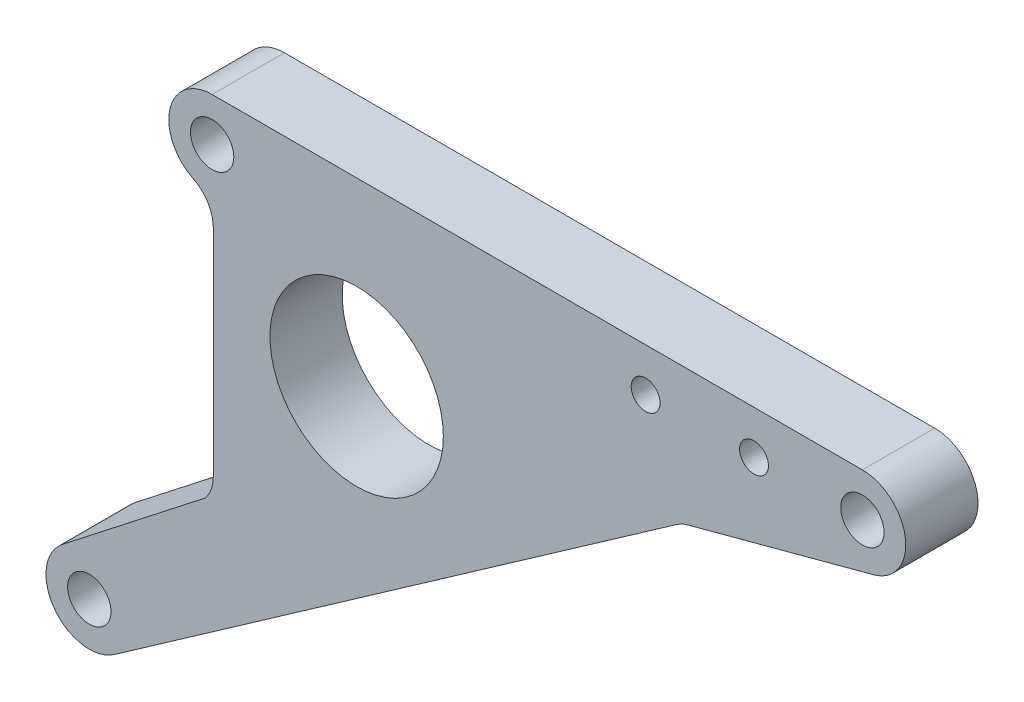
ISO-10303-21;
HEADER;
FILE_DESCRIPTION(('STEP AP214'),'2;1');
FILE_NAME('part.step','',(''),(''),'','','');
FILE_SCHEMA(('AUTOMOTIVE_DESIGN { 1 0 10303 214 1 1 1 1 }'));
ENDSEC;
DATA;
#1=APPLICATION_CONTEXT('core data for automotive mechanical design processes');
#2=APPLICATION_PROTOCOL_DEFINITION('international standard','automotive_design',2000,#1);
#3=PRODUCT_CONTEXT('',#1,'mechanical');
#4=PRODUCT('Part','Part','',(#3));
#5=PRODUCT_RELATED_PRODUCT_CATEGORY('part','',(#4));
#6=PRODUCT_DEFINITION_FORMATION('','',#4);
#7=PRODUCT_DEFINITION_CONTEXT('part definition',#1,'design');
#8=PRODUCT_DEFINITION('design','',#6,#7);
#9=PRODUCT_DEFINITION_SHAPE('','',#8);
#10=(LENGTH_UNIT() NAMED_UNIT(*) SI_UNIT(.MILLI.,.METRE.));
#11=(NAMED_UNIT(*) PLANE_ANGLE_UNIT() SI_UNIT($,.RADIAN.));
#12=(NAMED_UNIT(*) SI_UNIT($,.STERADIAN.) SOLID_ANGLE_UNIT());
#13=UNCERTAINTY_MEASURE_WITH_UNIT(LENGTH_MEASURE(1.E-05),#10,'distance_accuracy_value','');
#14=(GEOMETRIC_REPRESENTATION_CONTEXT(3) GLOBAL_UNCERTAINTY_ASSIGNED_CONTEXT((#13)) GLOBAL_UNIT_ASSIGNED_CONTEXT((#10,
#11,#12)) REPRESENTATION_CONTEXT('',''));
#15=CARTESIAN_POINT('',(0.,0.,0.));
#16=DIRECTION('',(0.,0.,1.));
#17=DIRECTION('',(1.,0.,0.));
#18=AXIS2_PLACEMENT_3D('',#15,#16,#17);
#19=CARTESIAN_POINT('',(16.0863109995939,48.5462870567651,10.));
#20=DIRECTION('',(0.,0.,1.));
#21=DIRECTION('',(1.,0.,0.));
#22=AXIS2_PLACEMENT_3D('',#19,#20,#21);
#23=PLANE('',#22);
#24=CARTESIAN_POINT('',(-90.9136890004061,-14.4537129432349,10.));
#25=DIRECTION('',(0.,0.,1.));
#26=DIRECTION('',(1.,0.,0.));
#27=AXIS2_PLACEMENT_3D('',#24,#25,#26);
#28=CIRCLE('',#27,3.00000000000001);
#29=CARTESIAN_POINT('',(-87.9136890004061,-14.4537129432349,10.));
#30=VERTEX_POINT('',#29);
#31=EDGE_CURVE('E285',#30,#30,#28,.T.);
#32=ORIENTED_EDGE('',*,*,#31,.F.);
#33=EDGE_LOOP('',(#32));
#34=FACE_BOUND('',#33,.T.);
#35=CARTESIAN_POINT('',(-13.9136890004061,48.5462870567651,10.));
#36=DIRECTION('',(0.,0.,1.));
#37=DIRECTION('',(1.,0.,0.));
#38=AXIS2_PLACEMENT_3D('',#35,#36,#37);
#39=CIRCLE('',#38,2.);
#40=CARTESIAN_POINT('',(-11.9136890004061,48.5462870567651,10.));
#41=VERTEX_POINT('',#40);
#42=EDGE_CURVE('E297',#41,#41,#39,.T.);
#43=ORIENTED_EDGE('',*,*,#42,.F.);
#44=EDGE_LOOP('',(#43));
#45=FACE_BOUND('',#44,.T.);
#46=CARTESIAN_POINT('',(16.0863109995939,48.5462870567651,10.));
#47=DIRECTION('',(0.,0.,1.));
#48=DIRECTION('',(1.,0.,0.));
#49=AXIS2_PLACEMENT_3D('',#46,#47,#48);
#50=CIRCLE('',#49,3.);
#51=CARTESIAN_POINT('',(19.0863109995939,48.5462870567651,10.));
#52=VERTEX_POINT('',#51);
#53=EDGE_CURVE('E152',#52,#52,#50,.T.);
#54=ORIENTED_EDGE('',*,*,#53,.F.);
#55=EDGE_LOOP('',(#54));
#56=FACE_BOUND('',#55,.T.);
#57=CARTESIAN_POINT('',(16.0863109995939,48.5462870567651,10.));
#58=DIRECTION('',(0.,0.,1.));
#59=DIRECTION('',(1.,0.,0.));
#60=AXIS2_PLACEMENT_3D('',#57,#58,#59);
#61=CIRCLE('',#60,6.);
#62=CARTESIAN_POINT('',(17.639225270209,42.7507320990307,10.));
#63=VERTEX_POINT('',#62);
#64=CARTESIAN_POINT('',(16.0863109995939,54.5462870567651,10.));
#65=VERTEX_POINT('',#64);
#66=EDGE_CURVE('E169',#63,#65,#61,.T.);
#67=ORIENTED_EDGE('',*,*,#66,.T.);
#68=DIRECTION('',(-1.,0.,0.));
#69=VECTOR('',#68,1.);
#70=CARTESIAN_POINT('',(16.0863109995939,54.5462870567651,10.));
#71=LINE('',#70,#69);
#72=CARTESIAN_POINT('',(-73.9136890004061,54.5462870567651,10.));
#73=VERTEX_POINT('',#72);
#74=EDGE_CURVE('E102',#65,#73,#71,.T.);
#75=ORIENTED_EDGE('',*,*,#74,.T.);
#76=CARTESIAN_POINT('',(-73.9136890004061,48.5462870567651,10.));
#77=DIRECTION('',(0.,0.,1.));
#78=DIRECTION('',(1.,0.,0.));
#79=AXIS2_PLACEMENT_3D('',#76,#77,#78);
#80=CIRCLE('',#79,6.);
#81=CARTESIAN_POINT('',(-76.5543108859951,43.1586051751626,10.));
#82=VERTEX_POINT('',#81);
#83=EDGE_CURVE('E193',#73,#82,#80,.T.);
#84=ORIENTED_EDGE('',*,*,#83,.T.);
#85=CARTESIAN_POINT('',(-78.7548291239859,38.6688702738271,10.));
#86=DIRECTION('',(0.,0.,-1.));
#87=DIRECTION('',(-1.,0.,0.));
#88=AXIS2_PLACEMENT_3D('',#85,#86,#87);
#89=CIRCLE('',#88,5.);
#90=CARTESIAN_POINT('',(-73.7548291239859,38.6688702738271,10.));
#91=VERTEX_POINT('',#90);
#92=EDGE_CURVE('E212',#82,#91,#89,.T.);
#93=ORIENTED_EDGE('',*,*,#92,.T.);
#94=DIRECTION('',(0.,-1.,0.));
#95=VECTOR('',#94,1.);
#96=CARTESIAN_POINT('',(-73.7548291239859,38.6688702738271,10.));
#97=LINE('',#96,#95);
#98=CARTESIAN_POINT('',(-73.7548291239859,8.83341218500627,10.));
#99=VERTEX_POINT('',#98);
#100=EDGE_CURVE('E209',#91,#99,#97,.T.);
#101=ORIENTED_EDGE('',*,*,#100,.T.);
#102=CARTESIAN_POINT('',(-78.7548291239859,8.83341218500627,10.));
#103=DIRECTION('',(0.,0.,-1.));
#104=DIRECTION('',(-1.,0.,0.));
#105=AXIS2_PLACEMENT_3D('',#102,#103,#104);
#106=CIRCLE('',#105,4.99999999999999);
#107=CARTESIAN_POINT('',(-74.8496115638818,5.71102915144772,10.));
#108=VERTEX_POINT('',#107);
#109=EDGE_CURVE('E211',#99,#108,#106,.T.);
#110=ORIENTED_EDGE('',*,*,#109,.T.);
#111=DIRECTION('',(-0.788010753606726,-0.615661475325654,0.));
#112=VECTOR('',#111,1.);
#113=CARTESIAN_POINT('',(-74.8496115638818,5.71102915144772,10.));
#114=LINE('',#113,#112);
#115=CARTESIAN_POINT('',(-94.60765785236,-9.72564842159455,10.));
#116=VERTEX_POINT('',#115);
#117=EDGE_CURVE('E214',#108,#116,#114,.T.);
#118=ORIENTED_EDGE('',*,*,#117,.T.);
#119=CARTESIAN_POINT('',(-90.9136890004061,-14.4537129432349,10.));
#120=DIRECTION('',(0.,0.,1.));
#121=DIRECTION('',(1.,0.,0.));
#122=AXIS2_PLACEMENT_3D('',#119,#120,#121);
#123=CIRCLE('',#122,6.);
#124=CARTESIAN_POINT('',(-87.4722303822998,-19.3686252089689,10.));
#125=VERTEX_POINT('',#124);
#126=EDGE_CURVE('E130',#116,#125,#123,.T.);
#127=ORIENTED_EDGE('',*,*,#126,.T.);
#128=DIRECTION('',(0.819152044288991,0.573576436351047,0.));
#129=VECTOR('',#128,1.);
#130=CARTESIAN_POINT('',(-87.4722303822998,-19.3686252089689,10.));
#131=LINE('',#130,#129);
#132=CARTESIAN_POINT('',(-9.64226130666265,35.128505836421,10.));
#133=VERTEX_POINT('',#132);
#134=EDGE_CURVE('E124',#125,#133,#131,.T.);
#135=ORIENTED_EDGE('',*,*,#134,.T.);
#136=CARTESIAN_POINT('',(-6.77437912490741,31.0327456149761,10.));
#137=DIRECTION('',(0.,0.,-1.));
#138=DIRECTION('',(1.,0.,0.));
#139=AXIS2_PLACEMENT_3D('',#136,#137,#138);
#140=CIRCLE('',#139,4.99999999999999);
#141=CARTESIAN_POINT('',(-8.06847435041998,35.8623747464214,10.));
#142=VERTEX_POINT('',#141);
#143=EDGE_CURVE('E128',#133,#142,#140,.T.);
#144=ORIENTED_EDGE('',*,*,#143,.T.);
#145=DIRECTION('',(0.96592582628907,0.258819045102515,0.));
#146=VECTOR('',#145,1.);
#147=CARTESIAN_POINT('',(-8.06847435041998,35.8623747464214,10.));
#148=LINE('',#147,#146);
#149=EDGE_CURVE('E50',#142,#63,#148,.T.);
#150=ORIENTED_EDGE('',*,*,#149,.T.);
#151=EDGE_LOOP('',(#67,#75,#84,#93,#101,#110,#118,#127,#135,#144,#150));
#152=FACE_BOUND('',#151,.T.);
#153=CARTESIAN_POINT('',(1.08631099959389,48.5462870567651,10.));
#154=DIRECTION('',(0.,0.,1.));
#155=DIRECTION('',(1.,0.,0.));
#156=AXIS2_PLACEMENT_3D('',#153,#154,#155);
#157=CIRCLE('',#156,2.);
#158=CARTESIAN_POINT('',(3.0863109995939,48.5462870567651,10.));
#159=VERTEX_POINT('',#158);
#160=EDGE_CURVE('E303',#159,#159,#157,.T.);
#161=ORIENTED_EDGE('',*,*,#160,.F.);
#162=EDGE_LOOP('',(#161));
#163=FACE_BOUND('',#162,.T.);
#164=CARTESIAN_POINT('',(-73.9136890004061,48.5462870567651,10.));
#165=DIRECTION('',(0.,0.,1.));
#166=DIRECTION('',(1.,0.,0.));
#167=AXIS2_PLACEMENT_3D('',#164,#165,#166);
#168=CIRCLE('',#167,3.00000000000001);
#169=CARTESIAN_POINT('',(-70.9136890004061,48.5462870567651,10.));
#170=VERTEX_POINT('',#169);
#171=EDGE_CURVE('E291',#170,#170,#168,.T.);
#172=ORIENTED_EDGE('',*,*,#171,.F.);
#173=EDGE_LOOP('',(#172));
#174=FACE_BOUND('',#173,.T.);
#175=CARTESIAN_POINT('',(-53.9136890004061,29.5462870567651,10.));
#176=DIRECTION('',(0.,0.,1.));
#177=DIRECTION('',(1.,0.,0.));
#178=AXIS2_PLACEMENT_3D('',#175,#176,#177);
#179=CIRCLE('',#178,12.);
#180=CARTESIAN_POINT('',(-41.9136890004061,29.5462870567651,10.));
#181=VERTEX_POINT('',#180);
#182=EDGE_CURVE('E276',#181,#181,#179,.T.);
#183=ORIENTED_EDGE('',*,*,#182,.F.);
#184=EDGE_LOOP('',(#183));
#185=FACE_BOUND('',#184,.T.);
#186=ADVANCED_FACE('F33',(#34,#45,#56,#152,#163,#174,#185),#23,.T.);
#187=CARTESIAN_POINT('',(16.0863109995939,48.5462870567651,0.));
#188=DIRECTION('',(0.,0.,1.));
#189=DIRECTION('',(1.,0.,0.));
#190=AXIS2_PLACEMENT_3D('',#187,#188,#189);
#191=PLANE('',#190);
#192=CARTESIAN_POINT('',(16.0863109995939,48.5462870567651,0.));
#193=DIRECTION('',(0.,0.,1.));
#194=DIRECTION('',(1.,0.,0.));
#195=AXIS2_PLACEMENT_3D('',#192,#193,#194);
#196=CIRCLE('',#195,6.);
#197=CARTESIAN_POINT('',(17.639225270209,42.7507320990307,0.));
#198=VERTEX_POINT('',#197);
#199=CARTESIAN_POINT('',(16.0863109995939,54.5462870567651,0.));
#200=VERTEX_POINT('',#199);
#201=EDGE_CURVE('E148',#198,#200,#196,.T.);
#202=ORIENTED_EDGE('',*,*,#201,.F.);
#203=DIRECTION('',(0.96592582628907,0.258819045102515,0.));
#204=VECTOR('',#203,1.);
#205=CARTESIAN_POINT('',(-8.06847435041998,35.8623747464214,0.));
#206=LINE('',#205,#204);
#207=CARTESIAN_POINT('',(-8.06847435041998,35.8623747464214,0.));
#208=VERTEX_POINT('',#207);
#209=EDGE_CURVE('E94',#208,#198,#206,.T.);
#210=ORIENTED_EDGE('',*,*,#209,.F.);
#211=CARTESIAN_POINT('',(-6.77437912490741,31.0327456149761,0.));
#212=DIRECTION('',(0.,0.,-1.));
#213=DIRECTION('',(1.,0.,0.));
#214=AXIS2_PLACEMENT_3D('',#211,#212,#213);
#215=CIRCLE('',#214,4.99999999999999);
#216=CARTESIAN_POINT('',(-9.64226130666265,35.128505836421,0.));
#217=VERTEX_POINT('',#216);
#218=EDGE_CURVE('E88',#217,#208,#215,.T.);
#219=ORIENTED_EDGE('',*,*,#218,.F.);
#220=DIRECTION('',(0.819152044288991,0.573576436351047,0.));
#221=VECTOR('',#220,1.);
#222=CARTESIAN_POINT('',(-87.4722303822998,-19.3686252089689,0.));
#223=LINE('',#222,#221);
#224=CARTESIAN_POINT('',(-87.4722303822998,-19.3686252089689,0.));
#225=VERTEX_POINT('',#224);
#226=EDGE_CURVE('E138',#225,#217,#223,.T.);
#227=ORIENTED_EDGE('',*,*,#226,.F.);
#228=CARTESIAN_POINT('',(-90.9136890004061,-14.4537129432349,0.));
#229=DIRECTION('',(0.,0.,1.));
#230=DIRECTION('',(1.,0.,0.));
#231=AXIS2_PLACEMENT_3D('',#228,#229,#230);
#232=CIRCLE('',#231,6.);
#233=CARTESIAN_POINT('',(-94.60765785236,-9.72564842159455,0.));
#234=VERTEX_POINT('',#233);
#235=EDGE_CURVE('E164',#234,#225,#232,.T.);
#236=ORIENTED_EDGE('',*,*,#235,.F.);
#237=DIRECTION('',(-0.788010753606726,-0.615661475325654,0.));
#238=VECTOR('',#237,1.);
#239=CARTESIAN_POINT('',(-74.8496115638818,5.71102915144772,0.));
#240=LINE('',#239,#238);
#241=CARTESIAN_POINT('',(-74.8496115638818,5.71102915144772,0.));
#242=VERTEX_POINT('',#241);
#243=EDGE_CURVE('E162',#242,#234,#240,.T.);
#244=ORIENTED_EDGE('',*,*,#243,.F.);
#245=CARTESIAN_POINT('',(-78.7548291239859,8.83341218500627,0.));
#246=DIRECTION('',(0.,0.,-1.));
#247=DIRECTION('',(-1.,0.,0.));
#248=AXIS2_PLACEMENT_3D('',#245,#246,#247);
#249=CIRCLE('',#248,4.99999999999999);
#250=CARTESIAN_POINT('',(-73.7548291239859,8.83341218500627,0.));
#251=VERTEX_POINT('',#250);
#252=EDGE_CURVE('E160',#251,#242,#249,.T.);
#253=ORIENTED_EDGE('',*,*,#252,.F.);
#254=DIRECTION('',(0.,-1.,0.));
#255=VECTOR('',#254,1.);
#256=CARTESIAN_POINT('',(-73.7548291239859,38.6688702738271,0.));
#257=LINE('',#256,#255);
#258=CARTESIAN_POINT('',(-73.7548291239859,38.6688702738271,0.));
#259=VERTEX_POINT('',#258);
#260=EDGE_CURVE('E158',#259,#251,#257,.T.);
#261=ORIENTED_EDGE('',*,*,#260,.F.);
#262=CARTESIAN_POINT('',(-78.7548291239859,38.6688702738271,0.));
#263=DIRECTION('',(0.,0.,-1.));
#264=DIRECTION('',(-1.,0.,0.));
#265=AXIS2_PLACEMENT_3D('',#262,#263,#264);
#266=CIRCLE('',#265,5.);
#267=CARTESIAN_POINT('',(-76.5543108859951,43.1586051751626,0.));
#268=VERTEX_POINT('',#267);
#269=EDGE_CURVE('E156',#268,#259,#266,.T.);
#270=ORIENTED_EDGE('',*,*,#269,.F.);
#271=CARTESIAN_POINT('',(-73.9136890004061,48.5462870567651,0.));
#272=DIRECTION('',(0.,0.,1.));
#273=DIRECTION('',(1.,0.,0.));
#274=AXIS2_PLACEMENT_3D('',#271,#272,#273);
#275=CIRCLE('',#274,6.);
#276=CARTESIAN_POINT('',(-73.9136890004061,54.5462870567651,0.));
#277=VERTEX_POINT('',#276);
#278=EDGE_CURVE('E154',#277,#268,#275,.T.);
#279=ORIENTED_EDGE('',*,*,#278,.F.);
#280=DIRECTION('',(-1.,0.,0.));
#281=VECTOR('',#280,1.);
#282=CARTESIAN_POINT('',(16.0863109995939,54.5462870567651,0.));
#283=LINE('',#282,#281);
#284=EDGE_CURVE('E151',#200,#277,#283,.T.);
#285=ORIENTED_EDGE('',*,*,#284,.F.);
#286=EDGE_LOOP('',(#202,#210,#219,#227,#236,#244,#253,#261,#270,#279,#285));
#287=FACE_BOUND('',#286,.T.);
#288=CARTESIAN_POINT('',(16.0863109995939,48.5462870567651,0.));
#289=DIRECTION('',(0.,0.,1.));
#290=DIRECTION('',(1.,0.,0.));
#291=AXIS2_PLACEMENT_3D('',#288,#289,#290);
#292=CIRCLE('',#291,3.);
#293=CARTESIAN_POINT('',(19.0863109995939,48.5462870567651,0.));
#294=VERTEX_POINT('',#293);
#295=EDGE_CURVE('E306',#294,#294,#292,.T.);
#296=ORIENTED_EDGE('',*,*,#295,.T.);
#297=EDGE_LOOP('',(#296));
#298=FACE_BOUND('',#297,.T.);
#299=CARTESIAN_POINT('',(1.08631099959389,48.5462870567651,0.));
#300=DIRECTION('',(0.,0.,1.));
#301=DIRECTION('',(1.,0.,0.));
#302=AXIS2_PLACEMENT_3D('',#299,#300,#301);
#303=CIRCLE('',#302,2.);
#304=CARTESIAN_POINT('',(3.0863109995939,48.5462870567651,0.));
#305=VERTEX_POINT('',#304);
#306=EDGE_CURVE('E300',#305,#305,#303,.T.);
#307=ORIENTED_EDGE('',*,*,#306,.T.);
#308=EDGE_LOOP('',(#307));
#309=FACE_BOUND('',#308,.T.);
#310=CARTESIAN_POINT('',(-13.9136890004061,48.5462870567651,0.));
#311=DIRECTION('',(0.,0.,1.));
#312=DIRECTION('',(1.,0.,0.));
#313=AXIS2_PLACEMENT_3D('',#310,#311,#312);
#314=CIRCLE('',#313,2.);
#315=CARTESIAN_POINT('',(-11.9136890004061,48.5462870567651,0.));
#316=VERTEX_POINT('',#315);
#317=EDGE_CURVE('E294',#316,#316,#314,.T.);
#318=ORIENTED_EDGE('',*,*,#317,.T.);
#319=EDGE_LOOP('',(#318));
#320=FACE_BOUND('',#319,.T.);
#321=CARTESIAN_POINT('',(-73.9136890004061,48.5462870567651,0.));
#322=DIRECTION('',(0.,0.,1.));
#323=DIRECTION('',(1.,0.,0.));
#324=AXIS2_PLACEMENT_3D('',#321,#322,#323);
#325=CIRCLE('',#324,3.00000000000001);
#326=CARTESIAN_POINT('',(-70.9136890004061,48.5462870567651,0.));
#327=VERTEX_POINT('',#326);
#328=EDGE_CURVE('E288',#327,#327,#325,.T.);
#329=ORIENTED_EDGE('',*,*,#328,.T.);
#330=EDGE_LOOP('',(#329));
#331=FACE_BOUND('',#330,.T.);
#332=CARTESIAN_POINT('',(-90.9136890004061,-14.4537129432349,0.));
#333=DIRECTION('',(0.,0.,1.));
#334=DIRECTION('',(1.,0.,0.));
#335=AXIS2_PLACEMENT_3D('',#332,#333,#334);
#336=CIRCLE('',#335,3.00000000000001);
#337=CARTESIAN_POINT('',(-87.9136890004061,-14.4537129432349,0.));
#338=VERTEX_POINT('',#337);
#339=EDGE_CURVE('E282',#338,#338,#336,.T.);
#340=ORIENTED_EDGE('',*,*,#339,.T.);
#341=EDGE_LOOP('',(#340));
#342=FACE_BOUND('',#341,.T.);
#343=CARTESIAN_POINT('',(-53.9136890004061,29.5462870567651,0.));
#344=DIRECTION('',(0.,0.,1.));
#345=DIRECTION('',(1.,0.,0.));
#346=AXIS2_PLACEMENT_3D('',#343,#344,#345);
#347=CIRCLE('',#346,12.);
#348=CARTESIAN_POINT('',(-41.9136890004061,29.5462870567651,0.));
#349=VERTEX_POINT('',#348);
#350=EDGE_CURVE('E279',#349,#349,#347,.T.);
#351=ORIENTED_EDGE('',*,*,#350,.T.);
#352=EDGE_LOOP('',(#351));
#353=FACE_BOUND('',#352,.T.);
#354=ADVANCED_FACE('F197',(#287,#298,#309,#320,#331,#342,#353),#191,.F.);
#355=CARTESIAN_POINT('',(16.0863109995939,48.5462870567651,10.));
#356=DIRECTION('',(0.,0.,-1.));
#357=DIRECTION('',(-1.,0.,0.));
#358=AXIS2_PLACEMENT_3D('',#355,#356,#357);
#359=CYLINDRICAL_SURFACE('',#358,6.);
#360=ORIENTED_EDGE('',*,*,#201,.T.);
#361=DIRECTION('',(0.,0.,-1.));
#362=VECTOR('',#361,1.);
#363=CARTESIAN_POINT('',(16.0863109995939,54.5462870567651,10.));
#364=LINE('',#363,#362);
#365=EDGE_CURVE('E11',#65,#200,#364,.T.);
#366=ORIENTED_EDGE('',*,*,#365,.F.);
#367=ORIENTED_EDGE('',*,*,#66,.F.);
#368=DIRECTION('',(0.,0.,-1.));
#369=VECTOR('',#368,1.);
#370=CARTESIAN_POINT('',(17.639225270209,42.7507320990307,10.));
#371=LINE('',#370,#369);
#372=EDGE_CURVE('E144',#63,#198,#371,.T.);
#373=ORIENTED_EDGE('',*,*,#372,.T.);
#374=EDGE_LOOP('',(#360,#366,#367,#373));
#375=FACE_BOUND('',#374,.T.);
#376=ADVANCED_FACE('F35',(#375),#359,.T.);
#377=CARTESIAN_POINT('',(16.0863109995939,54.5462870567651,10.));
#378=DIRECTION('',(0.,-1.,0.));
#379=DIRECTION('',(1.,0.,0.));
#380=AXIS2_PLACEMENT_3D('',#377,#378,#379);
#381=PLANE('',#380);
#382=ORIENTED_EDGE('',*,*,#284,.T.);
#383=DIRECTION('',(0.,0.,-1.));
#384=VECTOR('',#383,1.);
#385=CARTESIAN_POINT('',(-73.9136890004061,54.5462870567651,10.));
#386=LINE('',#385,#384);
#387=EDGE_CURVE('E42',#73,#277,#386,.T.);
#388=ORIENTED_EDGE('',*,*,#387,.F.);
#389=ORIENTED_EDGE('',*,*,#74,.F.);
#390=ORIENTED_EDGE('',*,*,#365,.T.);
#391=EDGE_LOOP('',(#382,#388,#389,#390));
#392=FACE_BOUND('',#391,.T.);
#393=ADVANCED_FACE('F424',(#392),#381,.F.);
#394=CARTESIAN_POINT('',(-73.9136890004061,48.5462870567651,10.));
#395=DIRECTION('',(0.,0.,-1.));
#396=DIRECTION('',(-1.,0.,0.));
#397=AXIS2_PLACEMENT_3D('',#394,#395,#396);
#398=CYLINDRICAL_SURFACE('',#397,6.);
#399=ORIENTED_EDGE('',*,*,#278,.T.);
#400=DIRECTION('',(0.,0.,-1.));
#401=VECTOR('',#400,1.);
#402=CARTESIAN_POINT('',(-76.5543108859951,43.1586051751626,10.));
#403=LINE('',#402,#401);
#404=EDGE_CURVE('E185',#82,#268,#403,.T.);
#405=ORIENTED_EDGE('',*,*,#404,.F.);
#406=ORIENTED_EDGE('',*,*,#83,.F.);
#407=ORIENTED_EDGE('',*,*,#387,.T.);
#408=EDGE_LOOP('',(#399,#405,#406,#407));
#409=FACE_BOUND('',#408,.T.);
#410=ADVANCED_FACE('F191',(#409),#398,.T.);
#411=CARTESIAN_POINT('',(-78.7548291239859,38.6688702738271,10.));
#412=DIRECTION('',(0.,0.,-1.));
#413=DIRECTION('',(-1.,0.,0.));
#414=AXIS2_PLACEMENT_3D('',#411,#412,#413);
#415=CYLINDRICAL_SURFACE('',#414,5.);
#416=ORIENTED_EDGE('',*,*,#269,.T.);
#417=DIRECTION('',(0.,0.,-1.));
#418=VECTOR('',#417,1.);
#419=CARTESIAN_POINT('',(-73.7548291239859,38.6688702738271,10.));
#420=LINE('',#419,#418);
#421=EDGE_CURVE('E182',#91,#259,#420,.T.);
#422=ORIENTED_EDGE('',*,*,#421,.F.);
#423=ORIENTED_EDGE('',*,*,#92,.F.);
#424=ORIENTED_EDGE('',*,*,#404,.T.);
#425=EDGE_LOOP('',(#416,#422,#423,#424));
#426=FACE_BOUND('',#425,.T.);
#427=ADVANCED_FACE('F203',(#426),#415,.F.);
#428=CARTESIAN_POINT('',(-73.7548291239859,38.6688702738271,10.));
#429=DIRECTION('',(1.,0.,0.));
#430=DIRECTION('',(0.,1.,0.));
#431=AXIS2_PLACEMENT_3D('',#428,#429,#430);
#432=PLANE('',#431);
#433=ORIENTED_EDGE('',*,*,#260,.T.);
#434=DIRECTION('',(0.,0.,-1.));
#435=VECTOR('',#434,1.);
#436=CARTESIAN_POINT('',(-73.7548291239859,8.83341218500627,10.));
#437=LINE('',#436,#435);
#438=EDGE_CURVE('E179',#99,#251,#437,.T.);
#439=ORIENTED_EDGE('',*,*,#438,.F.);
#440=ORIENTED_EDGE('',*,*,#100,.F.);
#441=ORIENTED_EDGE('',*,*,#421,.T.);
#442=EDGE_LOOP('',(#433,#439,#440,#441));
#443=FACE_BOUND('',#442,.T.);
#444=ADVANCED_FACE('F207',(#443),#432,.F.);
#445=CARTESIAN_POINT('',(-78.7548291239859,8.83341218500627,10.));
#446=DIRECTION('',(0.,0.,-1.));
#447=DIRECTION('',(-1.,0.,0.));
#448=AXIS2_PLACEMENT_3D('',#445,#446,#447);
#449=CYLINDRICAL_SURFACE('',#448,4.99999999999999);
#450=ORIENTED_EDGE('',*,*,#252,.T.);
#451=DIRECTION('',(0.,0.,-1.));
#452=VECTOR('',#451,1.);
#453=CARTESIAN_POINT('',(-74.8496115638818,5.71102915144772,10.));
#454=LINE('',#453,#452);
#455=EDGE_CURVE('E176',#108,#242,#454,.T.);
#456=ORIENTED_EDGE('',*,*,#455,.F.);
#457=ORIENTED_EDGE('',*,*,#109,.F.);
#458=ORIENTED_EDGE('',*,*,#438,.T.);
#459=EDGE_LOOP('',(#450,#456,#457,#458));
#460=FACE_BOUND('',#459,.T.);
#461=ADVANCED_FACE('F390',(#460),#449,.F.);
#462=CARTESIAN_POINT('',(-74.8496115638818,5.71102915144772,10.));
#463=DIRECTION('',(0.615661475325654,-0.788010753606726,0.));
#464=DIRECTION('',(0.788010753606726,0.615661475325654,0.));
#465=AXIS2_PLACEMENT_3D('',#462,#463,#464);
#466=PLANE('',#465);
#467=ORIENTED_EDGE('',*,*,#243,.T.);
#468=DIRECTION('',(0.,0.,-1.));
#469=VECTOR('',#468,1.);
#470=CARTESIAN_POINT('',(-94.60765785236,-9.72564842159455,10.));
#471=LINE('',#470,#469);
#472=EDGE_CURVE('E173',#116,#234,#471,.T.);
#473=ORIENTED_EDGE('',*,*,#472,.F.);
#474=ORIENTED_EDGE('',*,*,#117,.F.);
#475=ORIENTED_EDGE('',*,*,#455,.T.);
#476=EDGE_LOOP('',(#467,#473,#474,#475));
#477=FACE_BOUND('',#476,.T.);
#478=ADVANCED_FACE('F223',(#477),#466,.F.);
#479=CARTESIAN_POINT('',(-90.9136890004061,-14.4537129432349,10.));
#480=DIRECTION('',(0.,0.,-1.));
#481=DIRECTION('',(-1.,0.,0.));
#482=AXIS2_PLACEMENT_3D('',#479,#480,#481);
#483=CYLINDRICAL_SURFACE('',#482,6.);
#484=ORIENTED_EDGE('',*,*,#235,.T.);
#485=DIRECTION('',(0.,0.,-1.));
#486=VECTOR('',#485,1.);
#487=CARTESIAN_POINT('',(-87.4722303822998,-19.3686252089689,10.));
#488=LINE('',#487,#486);
#489=EDGE_CURVE('E139',#125,#225,#488,.T.);
#490=ORIENTED_EDGE('',*,*,#489,.F.);
#491=ORIENTED_EDGE('',*,*,#126,.F.);
#492=ORIENTED_EDGE('',*,*,#472,.T.);
#493=EDGE_LOOP('',(#484,#490,#491,#492));
#494=FACE_BOUND('',#493,.T.);
#495=ADVANCED_FACE('F227',(#494),#483,.T.);
#496=CARTESIAN_POINT('',(-87.4722303822998,-19.3686252089689,10.));
#497=DIRECTION('',(-0.573576436351047,0.819152044288991,0.));
#498=DIRECTION('',(-0.819152044288991,-0.573576436351047,0.));
#499=AXIS2_PLACEMENT_3D('',#496,#497,#498);
#500=PLANE('',#499);
#501=ORIENTED_EDGE('',*,*,#226,.T.);
#502=DIRECTION('',(0.,0.,-1.));
#503=VECTOR('',#502,1.);
#504=CARTESIAN_POINT('',(-9.64226130666265,35.128505836421,10.));
#505=LINE('',#504,#503);
#506=EDGE_CURVE('E135',#133,#217,#505,.T.);
#507=ORIENTED_EDGE('',*,*,#506,.F.);
#508=ORIENTED_EDGE('',*,*,#134,.F.);
#509=ORIENTED_EDGE('',*,*,#489,.T.);
#510=EDGE_LOOP('',(#501,#507,#508,#509));
#511=FACE_BOUND('',#510,.T.);
#512=ADVANCED_FACE('F136',(#511),#500,.F.);
#513=CARTESIAN_POINT('',(-6.77437912490741,31.0327456149761,10.));
#514=DIRECTION('',(0.,0.,-1.));
#515=DIRECTION('',(-1.,0.,0.));
#516=AXIS2_PLACEMENT_3D('',#513,#514,#515);
#517=CYLINDRICAL_SURFACE('',#516,4.99999999999999);
#518=ORIENTED_EDGE('',*,*,#218,.T.);
#519=DIRECTION('',(0.,0.,-1.));
#520=VECTOR('',#519,1.);
#521=CARTESIAN_POINT('',(-8.06847435041998,35.8623747464214,10.));
#522=LINE('',#521,#520);
#523=EDGE_CURVE('E140',#142,#208,#522,.T.);
#524=ORIENTED_EDGE('',*,*,#523,.F.);
#525=ORIENTED_EDGE('',*,*,#143,.F.);
#526=ORIENTED_EDGE('',*,*,#506,.T.);
#527=EDGE_LOOP('',(#518,#524,#525,#526));
#528=FACE_BOUND('',#527,.T.);
#529=ADVANCED_FACE('F142',(#528),#517,.F.);
#530=CARTESIAN_POINT('',(-8.06847435041998,35.8623747464214,10.));
#531=DIRECTION('',(-0.258819045102515,0.96592582628907,0.));
#532=DIRECTION('',(-0.96592582628907,-0.258819045102515,0.));
#533=AXIS2_PLACEMENT_3D('',#530,#531,#532);
#534=PLANE('',#533);
#535=ORIENTED_EDGE('',*,*,#209,.T.);
#536=ORIENTED_EDGE('',*,*,#372,.F.);
#537=ORIENTED_EDGE('',*,*,#149,.F.);
#538=ORIENTED_EDGE('',*,*,#523,.T.);
#539=EDGE_LOOP('',(#535,#536,#537,#538));
#540=FACE_BOUND('',#539,.T.);
#541=ADVANCED_FACE('F231',(#540),#534,.F.);
#542=CARTESIAN_POINT('',(16.0863109995939,48.5462870567651,10.));
#543=DIRECTION('',(0.,0.,-1.));
#544=DIRECTION('',(-1.,0.,0.));
#545=AXIS2_PLACEMENT_3D('',#542,#543,#544);
#546=CYLINDRICAL_SURFACE('',#545,3.);
#547=ORIENTED_EDGE('',*,*,#53,.T.);
#548=EDGE_LOOP('',(#547));
#549=FACE_BOUND('',#548,.T.);
#550=ORIENTED_EDGE('',*,*,#295,.F.);
#551=EDGE_LOOP('',(#550));
#552=FACE_BOUND('',#551,.T.);
#553=ADVANCED_FACE('F233',(#549,#552),#546,.F.);
#554=CARTESIAN_POINT('',(1.08631099959389,48.5462870567651,10.));
#555=DIRECTION('',(0.,0.,-1.));
#556=DIRECTION('',(-1.,0.,0.));
#557=AXIS2_PLACEMENT_3D('',#554,#555,#556);
#558=CYLINDRICAL_SURFACE('',#557,2.);
#559=ORIENTED_EDGE('',*,*,#160,.T.);
#560=EDGE_LOOP('',(#559));
#561=FACE_BOUND('',#560,.T.);
#562=ORIENTED_EDGE('',*,*,#306,.F.);
#563=EDGE_LOOP('',(#562));
#564=FACE_BOUND('',#563,.T.);
#565=ADVANCED_FACE('F239',(#561,#564),#558,.F.);
#566=CARTESIAN_POINT('',(-13.9136890004061,48.5462870567651,10.));
#567=DIRECTION('',(0.,0.,-1.));
#568=DIRECTION('',(-1.,0.,0.));
#569=AXIS2_PLACEMENT_3D('',#566,#567,#568);
#570=CYLINDRICAL_SURFACE('',#569,2.);
#571=ORIENTED_EDGE('',*,*,#42,.T.);
#572=EDGE_LOOP('',(#571));
#573=FACE_BOUND('',#572,.T.);
#574=ORIENTED_EDGE('',*,*,#317,.F.);
#575=EDGE_LOOP('',(#574));
#576=FACE_BOUND('',#575,.T.);
#577=ADVANCED_FACE('F255',(#573,#576),#570,.F.);
#578=CARTESIAN_POINT('',(-73.9136890004061,48.5462870567651,10.));
#579=DIRECTION('',(0.,0.,-1.));
#580=DIRECTION('',(-1.,0.,0.));
#581=AXIS2_PLACEMENT_3D('',#578,#579,#580);
#582=CYLINDRICAL_SURFACE('',#581,3.00000000000001);
#583=ORIENTED_EDGE('',*,*,#171,.T.);
#584=EDGE_LOOP('',(#583));
#585=FACE_BOUND('',#584,.T.);
#586=ORIENTED_EDGE('',*,*,#328,.F.);
#587=EDGE_LOOP('',(#586));
#588=FACE_BOUND('',#587,.T.);
#589=ADVANCED_FACE('F259',(#585,#588),#582,.F.);
#590=CARTESIAN_POINT('',(-90.9136890004061,-14.4537129432349,10.));
#591=DIRECTION('',(0.,0.,-1.));
#592=DIRECTION('',(-1.,0.,0.));
#593=AXIS2_PLACEMENT_3D('',#590,#591,#592);
#594=CYLINDRICAL_SURFACE('',#593,3.00000000000001);
#595=ORIENTED_EDGE('',*,*,#31,.T.);
#596=EDGE_LOOP('',(#595));
#597=FACE_BOUND('',#596,.T.);
#598=ORIENTED_EDGE('',*,*,#339,.F.);
#599=EDGE_LOOP('',(#598));
#600=FACE_BOUND('',#599,.T.);
#601=ADVANCED_FACE('F263',(#597,#600),#594,.F.);
#602=CARTESIAN_POINT('',(-53.9136890004061,29.5462870567651,10.));
#603=DIRECTION('',(0.,0.,-1.));
#604=DIRECTION('',(-1.,0.,0.));
#605=AXIS2_PLACEMENT_3D('',#602,#603,#604);
#606=CYLINDRICAL_SURFACE('',#605,12.);
#607=ORIENTED_EDGE('',*,*,#182,.T.);
#608=EDGE_LOOP('',(#607));
#609=FACE_BOUND('',#608,.T.);
#610=ORIENTED_EDGE('',*,*,#350,.F.);
#611=EDGE_LOOP('',(#610));
#612=FACE_BOUND('',#611,.T.);
#613=ADVANCED_FACE('F267',(#609,#612),#606,.F.);
#614=CLOSED_SHELL('',(#186,#354,#376,#393,#410,#427,#444,#461,#478,#495,#512,#529,#541,#553,
#565,#577,#589,#601,#613));
#615=MANIFOLD_SOLID_BREP('B2',#614);
#616=ADVANCED_BREP_SHAPE_REPRESENTATION('',(#18,#615),#14);
#617=SHAPE_DEFINITION_REPRESENTATION(#9,#616);
ENDSEC;
END-ISO-10303-21;
